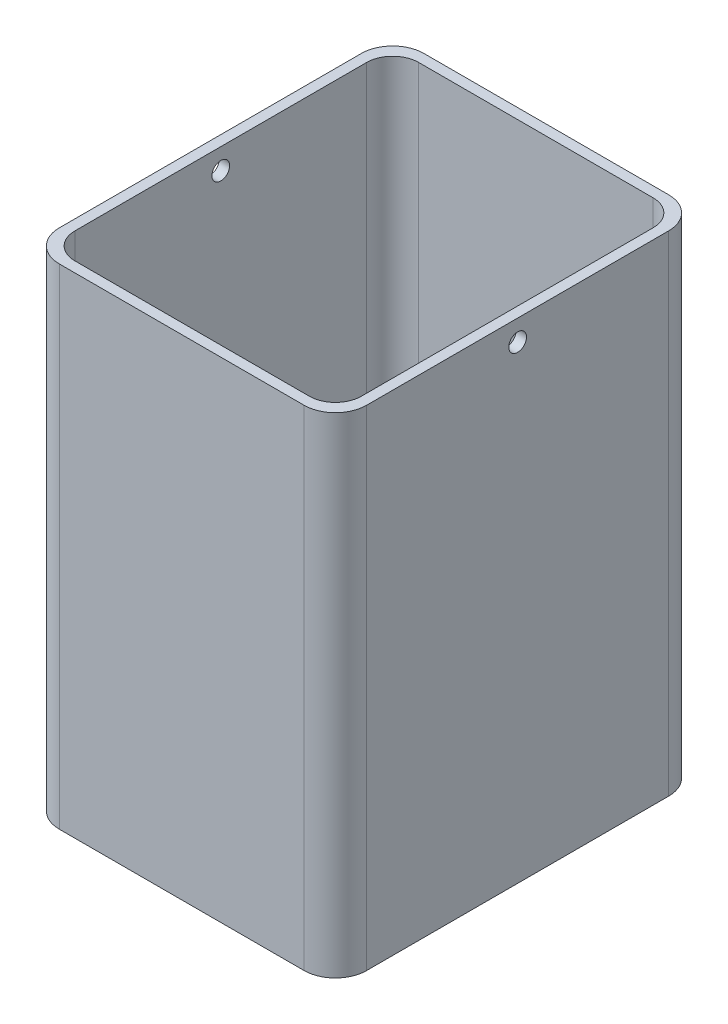
ISO-10303-21;
HEADER;
FILE_DESCRIPTION(('STEP AP214'),'2;1');
FILE_NAME('part.step','',(''),(''),'','','');
FILE_SCHEMA(('AUTOMOTIVE_DESIGN { 1 0 10303 214 1 1 1 1 }'));
ENDSEC;
DATA;
#1=APPLICATION_CONTEXT('core data for automotive mechanical design processes');
#2=APPLICATION_PROTOCOL_DEFINITION('international standard','automotive_design',2000,#1);
#3=PRODUCT_CONTEXT('',#1,'mechanical');
#4=PRODUCT('Part','Part','',(#3));
#5=PRODUCT_RELATED_PRODUCT_CATEGORY('part','',(#4));
#6=PRODUCT_DEFINITION_FORMATION('','',#4);
#7=PRODUCT_DEFINITION_CONTEXT('part definition',#1,'design');
#8=PRODUCT_DEFINITION('design','',#6,#7);
#9=PRODUCT_DEFINITION_SHAPE('','',#8);
#10=(LENGTH_UNIT() NAMED_UNIT(*) SI_UNIT(.MILLI.,.METRE.));
#11=(NAMED_UNIT(*) PLANE_ANGLE_UNIT() SI_UNIT($,.RADIAN.));
#12=(NAMED_UNIT(*) SI_UNIT($,.STERADIAN.) SOLID_ANGLE_UNIT());
#13=UNCERTAINTY_MEASURE_WITH_UNIT(LENGTH_MEASURE(1.E-05),#10,'distance_accuracy_value','');
#14=(GEOMETRIC_REPRESENTATION_CONTEXT(3) GLOBAL_UNCERTAINTY_ASSIGNED_CONTEXT((#13)) GLOBAL_UNIT_ASSIGNED_CONTEXT((#10,
#11,#12)) REPRESENTATION_CONTEXT('',''));
#15=CARTESIAN_POINT('',(0.,0.,0.));
#16=DIRECTION('',(0.,0.,1.));
#17=DIRECTION('',(1.,0.,0.));
#18=AXIS2_PLACEMENT_3D('',#15,#16,#17);
#19=CARTESIAN_POINT('',(0.,4.,70.0000002980232));
#20=DIRECTION('',(0.,0.,-1.));
#21=DIRECTION('',(-1.,0.,0.));
#22=AXIS2_PLACEMENT_3D('',#19,#20,#21);
#23=PLANE('',#22);
#24=DIRECTION('',(1.,0.,0.));
#25=VECTOR('',#24,1.);
#26=CARTESIAN_POINT('',(0.,0.,70.0000002980232));
#27=LINE('',#26,#25);
#28=CARTESIAN_POINT('',(6.00000098347664,0.,70.0000002980232));
#29=VERTEX_POINT('',#28);
#30=CARTESIAN_POINT('',(52.9999993741512,0.,70.0000002980232));
#31=VERTEX_POINT('',#30);
#32=EDGE_CURVE('E295',#29,#31,#27,.T.);
#33=ORIENTED_EDGE('',*,*,#32,.T.);
#34=DIRECTION('',(0.,-1.,0.));
#35=VECTOR('',#34,1.);
#36=CARTESIAN_POINT('',(52.9999993741512,4.,70.0000002980232));
#37=LINE('',#36,#35);
#38=CARTESIAN_POINT('',(53.0000003576278,94.,70.0000002980232));
#39=VERTEX_POINT('',#38);
#40=EDGE_CURVE('E12',#39,#31,#37,.T.);
#41=ORIENTED_EDGE('',*,*,#40,.F.);
#42=DIRECTION('',(-1.,0.,0.));
#43=VECTOR('',#42,1.);
#44=CARTESIAN_POINT('',(53.0000003576278,94.,70.0000002980232));
#45=LINE('',#44,#43);
#46=CARTESIAN_POINT('',(6.00000000000004,94.,70.0000002980232));
#47=VERTEX_POINT('',#46);
#48=EDGE_CURVE('E292',#39,#47,#45,.T.);
#49=ORIENTED_EDGE('',*,*,#48,.T.);
#50=DIRECTION('',(0.,-1.,0.));
#51=VECTOR('',#50,1.);
#52=CARTESIAN_POINT('',(6.00000098347664,4.,70.0000002980232));
#53=LINE('',#52,#51);
#54=EDGE_CURVE('E317',#47,#29,#53,.T.);
#55=ORIENTED_EDGE('',*,*,#54,.T.);
#56=EDGE_LOOP('',(#33,#41,#49,#55));
#57=FACE_BOUND('',#56,.T.);
#58=ADVANCED_FACE('F85',(#57),#23,.F.);
#59=CARTESIAN_POINT('',(52.9999975115061,4.,63.9999974519014));
#60=DIRECTION('',(0.,-1.,0.));
#61=DIRECTION('',(0.,0.,-1.));
#62=AXIS2_PLACEMENT_3D('',#59,#60,#61);
#63=CYLINDRICAL_SURFACE('',#62,6.00000284612208);
#64=CARTESIAN_POINT('',(52.9999975115061,0.,63.9999974519014));
#65=DIRECTION('',(0.,1.,0.));
#66=DIRECTION('',(0.,0.,1.));
#67=AXIS2_PLACEMENT_3D('',#64,#65,#66);
#68=CIRCLE('',#67,6.00000284612208);
#69=CARTESIAN_POINT('',(59.0000003576279,0.,63.9999955892563));
#70=VERTEX_POINT('',#69);
#71=EDGE_CURVE('E298',#31,#70,#68,.T.);
#72=ORIENTED_EDGE('',*,*,#71,.T.);
#73=DIRECTION('',(0.,-1.,0.));
#74=VECTOR('',#73,1.);
#75=CARTESIAN_POINT('',(59.0000003576279,4.,63.9999955892563));
#76=LINE('',#75,#74);
#77=CARTESIAN_POINT('',(59.0000003576279,94.,64.0000002980232));
#78=VERTEX_POINT('',#77);
#79=EDGE_CURVE('E93',#78,#70,#76,.T.);
#80=ORIENTED_EDGE('',*,*,#79,.F.);
#81=CARTESIAN_POINT('',(53.0000003576279,94.,64.0000002980232));
#82=DIRECTION('',(0.,1.,0.));
#83=DIRECTION('',(0.,0.,1.));
#84=AXIS2_PLACEMENT_3D('',#81,#82,#83);
#85=CIRCLE('',#84,6.);
#86=EDGE_CURVE('E256',#39,#78,#85,.T.);
#87=ORIENTED_EDGE('',*,*,#86,.F.);
#88=ORIENTED_EDGE('',*,*,#40,.T.);
#89=EDGE_LOOP('',(#72,#80,#87,#88));
#90=FACE_BOUND('',#89,.T.);
#91=ADVANCED_FACE('F337',(#90),#63,.T.);
#92=CARTESIAN_POINT('',(59.0000003576279,4.,0.));
#93=DIRECTION('',(1.,0.,0.));
#94=DIRECTION('',(0.,0.,-1.));
#95=AXIS2_PLACEMENT_3D('',#92,#93,#94);
#96=PLANE('',#95);
#97=CARTESIAN_POINT('',(59.0000003576279,90.,35.0000000976501));
#98=DIRECTION('',(1.,0.,0.));
#99=DIRECTION('',(0.,0.,-1.));
#100=AXIS2_PLACEMENT_3D('',#97,#98,#99);
#101=CIRCLE('',#100,1.7);
#102=CARTESIAN_POINT('',(59.0000003576279,90.,33.3000000976501));
#103=VERTEX_POINT('',#102);
#104=EDGE_CURVE('E384',#103,#103,#101,.T.);
#105=ORIENTED_EDGE('',*,*,#104,.F.);
#106=EDGE_LOOP('',(#105));
#107=FACE_BOUND('',#106,.T.);
#108=DIRECTION('',(0.,0.,1.));
#109=VECTOR('',#108,1.);
#110=CARTESIAN_POINT('',(59.0000003576279,0.,0.));
#111=LINE('',#110,#109);
#112=CARTESIAN_POINT('',(59.0000003576279,0.,6.00000098347664));
#113=VERTEX_POINT('',#112);
#114=EDGE_CURVE('E301',#113,#70,#111,.T.);
#115=ORIENTED_EDGE('',*,*,#114,.F.);
#116=DIRECTION('',(0.,-1.,0.));
#117=VECTOR('',#116,1.);
#118=CARTESIAN_POINT('',(59.0000003576279,4.,6.00000098347664));
#119=LINE('',#118,#117);
#120=CARTESIAN_POINT('',(59.0000003576279,94.,6.00000000000004));
#121=VERTEX_POINT('',#120);
#122=EDGE_CURVE('E329',#121,#113,#119,.T.);
#123=ORIENTED_EDGE('',*,*,#122,.F.);
#124=DIRECTION('',(0.,0.,1.));
#125=VECTOR('',#124,1.);
#126=CARTESIAN_POINT('',(59.0000003576279,94.,6.00000000000004));
#127=LINE('',#126,#125);
#128=EDGE_CURVE('E274',#121,#78,#127,.T.);
#129=ORIENTED_EDGE('',*,*,#128,.T.);
#130=ORIENTED_EDGE('',*,*,#79,.T.);
#131=EDGE_LOOP('',(#115,#123,#129,#130));
#132=FACE_BOUND('',#131,.T.);
#133=ADVANCED_FACE('F333',(#107,#132),#96,.T.);
#134=CARTESIAN_POINT('',(52.9999993741512,4.,6.00000098347665));
#135=DIRECTION('',(0.,-1.,0.));
#136=DIRECTION('',(0.,0.,-1.));
#137=AXIS2_PLACEMENT_3D('',#134,#135,#136);
#138=CYLINDRICAL_SURFACE('',#137,6.00000098347665);
#139=CARTESIAN_POINT('',(52.9999993741512,0.,6.00000098347665));
#140=DIRECTION('',(0.,1.,0.));
#141=DIRECTION('',(0.,0.,1.));
#142=AXIS2_PLACEMENT_3D('',#139,#140,#141);
#143=CIRCLE('',#142,6.00000098347665);
#144=CARTESIAN_POINT('',(52.9999993741512,0.,0.));
#145=VERTEX_POINT('',#144);
#146=EDGE_CURVE('E304',#145,#113,#143,.F.);
#147=ORIENTED_EDGE('',*,*,#146,.F.);
#148=DIRECTION('',(0.,-1.,0.));
#149=VECTOR('',#148,1.);
#150=CARTESIAN_POINT('',(52.9999993741512,4.,0.));
#151=LINE('',#150,#149);
#152=CARTESIAN_POINT('',(53.0000003576278,94.,0.));
#153=VERTEX_POINT('',#152);
#154=EDGE_CURVE('E327',#153,#145,#151,.T.);
#155=ORIENTED_EDGE('',*,*,#154,.F.);
#156=CARTESIAN_POINT('',(53.0000003576279,94.,6.));
#157=DIRECTION('',(0.,1.,0.));
#158=DIRECTION('',(0.,0.,1.));
#159=AXIS2_PLACEMENT_3D('',#156,#157,#158);
#160=CIRCLE('',#159,6.);
#161=EDGE_CURVE('E277',#121,#153,#160,.T.);
#162=ORIENTED_EDGE('',*,*,#161,.F.);
#163=ORIENTED_EDGE('',*,*,#122,.T.);
#164=EDGE_LOOP('',(#147,#155,#162,#163));
#165=FACE_BOUND('',#164,.T.);
#166=ADVANCED_FACE('F344',(#165),#138,.T.);
#167=CARTESIAN_POINT('',(0.,4.,0.));
#168=DIRECTION('',(0.,0.,-1.));
#169=DIRECTION('',(-1.,0.,0.));
#170=AXIS2_PLACEMENT_3D('',#167,#168,#169);
#171=PLANE('',#170);
#172=DIRECTION('',(1.,0.,0.));
#173=VECTOR('',#172,1.);
#174=CARTESIAN_POINT('',(0.,0.,0.));
#175=LINE('',#174,#173);
#176=CARTESIAN_POINT('',(6.00000098347664,0.,0.));
#177=VERTEX_POINT('',#176);
#178=EDGE_CURVE('E307',#177,#145,#175,.T.);
#179=ORIENTED_EDGE('',*,*,#178,.F.);
#180=DIRECTION('',(0.,-1.,0.));
#181=VECTOR('',#180,1.);
#182=CARTESIAN_POINT('',(6.00000098347664,4.,0.));
#183=LINE('',#182,#181);
#184=CARTESIAN_POINT('',(6.,94.,0.));
#185=VERTEX_POINT('',#184);
#186=EDGE_CURVE('E325',#185,#177,#183,.T.);
#187=ORIENTED_EDGE('',*,*,#186,.F.);
#188=DIRECTION('',(-1.,0.,0.));
#189=VECTOR('',#188,1.);
#190=CARTESIAN_POINT('',(53.0000003576278,94.,0.));
#191=LINE('',#190,#189);
#192=EDGE_CURVE('E280',#153,#185,#191,.T.);
#193=ORIENTED_EDGE('',*,*,#192,.F.);
#194=ORIENTED_EDGE('',*,*,#154,.T.);
#195=EDGE_LOOP('',(#179,#187,#193,#194));
#196=FACE_BOUND('',#195,.T.);
#197=ADVANCED_FACE('F362',(#196),#171,.T.);
#198=CARTESIAN_POINT('',(6.00000098347665,4.,6.00000098347665));
#199=DIRECTION('',(0.,-1.,0.));
#200=DIRECTION('',(0.,0.,-1.));
#201=AXIS2_PLACEMENT_3D('',#198,#199,#200);
#202=CYLINDRICAL_SURFACE('',#201,6.00000098347665);
#203=CARTESIAN_POINT('',(6.00000098347665,0.,6.00000098347665));
#204=DIRECTION('',(0.,1.,0.));
#205=DIRECTION('',(0.,0.,1.));
#206=AXIS2_PLACEMENT_3D('',#203,#204,#205);
#207=CIRCLE('',#206,6.00000098347665);
#208=CARTESIAN_POINT('',(0.,0.,6.00000098347664));
#209=VERTEX_POINT('',#208);
#210=EDGE_CURVE('E310',#209,#177,#207,.F.);
#211=ORIENTED_EDGE('',*,*,#210,.F.);
#212=DIRECTION('',(0.,-1.,0.));
#213=VECTOR('',#212,1.);
#214=CARTESIAN_POINT('',(0.,4.,6.00000098347664));
#215=LINE('',#214,#213);
#216=CARTESIAN_POINT('',(0.,94.,6.00000000000004));
#217=VERTEX_POINT('',#216);
#218=EDGE_CURVE('E323',#217,#209,#215,.T.);
#219=ORIENTED_EDGE('',*,*,#218,.F.);
#220=CARTESIAN_POINT('',(6.,94.,6.));
#221=DIRECTION('',(0.,-1.,0.));
#222=DIRECTION('',(0.,0.,-1.));
#223=AXIS2_PLACEMENT_3D('',#220,#221,#222);
#224=CIRCLE('',#223,6.);
#225=EDGE_CURVE('E283',#217,#185,#224,.T.);
#226=ORIENTED_EDGE('',*,*,#225,.T.);
#227=ORIENTED_EDGE('',*,*,#186,.T.);
#228=EDGE_LOOP('',(#211,#219,#226,#227));
#229=FACE_BOUND('',#228,.T.);
#230=ADVANCED_FACE('F360',(#229),#202,.T.);
#231=CARTESIAN_POINT('',(0.,4.,0.));
#232=DIRECTION('',(1.,0.,0.));
#233=DIRECTION('',(0.,0.,-1.));
#234=AXIS2_PLACEMENT_3D('',#231,#232,#233);
#235=PLANE('',#234);
#236=CARTESIAN_POINT('',(0.,90.,35.0000000976501));
#237=DIRECTION('',(1.,0.,0.));
#238=DIRECTION('',(0.,0.,-1.));
#239=AXIS2_PLACEMENT_3D('',#236,#237,#238);
#240=CIRCLE('',#239,1.7);
#241=CARTESIAN_POINT('',(0.,90.,33.3000000976501));
#242=VERTEX_POINT('',#241);
#243=EDGE_CURVE('E224',#242,#242,#240,.T.);
#244=ORIENTED_EDGE('',*,*,#243,.T.);
#245=EDGE_LOOP('',(#244));
#246=FACE_BOUND('',#245,.T.);
#247=DIRECTION('',(0.,0.,1.));
#248=VECTOR('',#247,1.);
#249=CARTESIAN_POINT('',(0.,0.,0.));
#250=LINE('',#249,#248);
#251=CARTESIAN_POINT('',(0.,0.,63.9999955892563));
#252=VERTEX_POINT('',#251);
#253=EDGE_CURVE('E313',#209,#252,#250,.T.);
#254=ORIENTED_EDGE('',*,*,#253,.T.);
#255=DIRECTION('',(0.,-1.,0.));
#256=VECTOR('',#255,1.);
#257=CARTESIAN_POINT('',(0.,4.,63.9999955892563));
#258=LINE('',#257,#256);
#259=CARTESIAN_POINT('',(0.,94.,64.0000002980232));
#260=VERTEX_POINT('',#259);
#261=EDGE_CURVE('E320',#260,#252,#258,.T.);
#262=ORIENTED_EDGE('',*,*,#261,.F.);
#263=DIRECTION('',(0.,0.,-1.));
#264=VECTOR('',#263,1.);
#265=CARTESIAN_POINT('',(0.,94.,64.0000002980232));
#266=LINE('',#265,#264);
#267=EDGE_CURVE('E286',#260,#217,#266,.T.);
#268=ORIENTED_EDGE('',*,*,#267,.T.);
#269=ORIENTED_EDGE('',*,*,#218,.T.);
#270=EDGE_LOOP('',(#254,#262,#268,#269));
#271=FACE_BOUND('',#270,.T.);
#272=ADVANCED_FACE('F357',(#246,#271),#235,.F.);
#273=CARTESIAN_POINT('',(5.99999656520715,4.,64.0000037328122));
#274=DIRECTION('',(0.,-1.,0.));
#275=DIRECTION('',(0.,0.,-1.));
#276=AXIS2_PLACEMENT_3D('',#273,#274,#275);
#277=CYLINDRICAL_SURFACE('',#276,5.99999656521268);
#278=CARTESIAN_POINT('',(5.99999656520715,0.,64.0000037328122));
#279=DIRECTION('',(0.,1.,0.));
#280=DIRECTION('',(0.,0.,1.));
#281=AXIS2_PLACEMENT_3D('',#278,#279,#280);
#282=CIRCLE('',#281,5.99999656521268);
#283=EDGE_CURVE('E315',#252,#29,#282,.T.);
#284=ORIENTED_EDGE('',*,*,#283,.T.);
#285=ORIENTED_EDGE('',*,*,#54,.F.);
#286=CARTESIAN_POINT('',(6.,94.,64.0000002980232));
#287=DIRECTION('',(0.,-1.,0.));
#288=DIRECTION('',(0.,0.,-1.));
#289=AXIS2_PLACEMENT_3D('',#286,#287,#288);
#290=CIRCLE('',#289,6.);
#291=EDGE_CURVE('E289',#47,#260,#290,.T.);
#292=ORIENTED_EDGE('',*,*,#291,.T.);
#293=ORIENTED_EDGE('',*,*,#261,.T.);
#294=EDGE_LOOP('',(#284,#285,#292,#293));
#295=FACE_BOUND('',#294,.T.);
#296=ADVANCED_FACE('F355',(#295),#277,.T.);
#297=CARTESIAN_POINT('',(0.,0.,0.));
#298=DIRECTION('',(0.,1.,0.));
#299=DIRECTION('',(0.,0.,1.));
#300=AXIS2_PLACEMENT_3D('',#297,#298,#299);
#301=PLANE('',#300);
#302=ORIENTED_EDGE('',*,*,#32,.F.);
#303=ORIENTED_EDGE('',*,*,#283,.F.);
#304=ORIENTED_EDGE('',*,*,#253,.F.);
#305=ORIENTED_EDGE('',*,*,#210,.T.);
#306=ORIENTED_EDGE('',*,*,#178,.T.);
#307=ORIENTED_EDGE('',*,*,#146,.T.);
#308=ORIENTED_EDGE('',*,*,#114,.T.);
#309=ORIENTED_EDGE('',*,*,#71,.F.);
#310=EDGE_LOOP('',(#302,#303,#304,#305,#306,#307,#308,#309));
#311=FACE_BOUND('',#310,.T.);
#312=ADVANCED_FACE('F340',(#311),#301,.F.);
#313=CARTESIAN_POINT('',(53.0000003576279,94.,64.0000002980232));
#314=DIRECTION('',(0.,1.,0.));
#315=DIRECTION('',(0.,0.,1.));
#316=AXIS2_PLACEMENT_3D('',#313,#314,#315);
#317=PLANE('',#316);
#318=CARTESIAN_POINT('',(7.,94.,63.0000002980232));
#319=DIRECTION('',(0.,-1.,0.));
#320=DIRECTION('',(0.,0.,-1.));
#321=AXIS2_PLACEMENT_3D('',#318,#319,#320);
#322=CIRCLE('',#321,5.);
#323=CARTESIAN_POINT('',(7.00000000000003,94.,68.0000002980232));
#324=VERTEX_POINT('',#323);
#325=CARTESIAN_POINT('',(2.00000000000001,94.,63.0000002980232));
#326=VERTEX_POINT('',#325);
#327=EDGE_CURVE('E209',#324,#326,#322,.T.);
#328=ORIENTED_EDGE('',*,*,#327,.T.);
#329=DIRECTION('',(0.,0.,1.));
#330=VECTOR('',#329,1.);
#331=CARTESIAN_POINT('',(2.,94.,7.00000000000003));
#332=LINE('',#331,#330);
#333=CARTESIAN_POINT('',(2.,94.,7.00000000000004));
#334=VERTEX_POINT('',#333);
#335=EDGE_CURVE('E198',#334,#326,#332,.T.);
#336=ORIENTED_EDGE('',*,*,#335,.F.);
#337=CARTESIAN_POINT('',(7.,94.,7.));
#338=DIRECTION('',(0.,-1.,0.));
#339=DIRECTION('',(0.,0.,-1.));
#340=AXIS2_PLACEMENT_3D('',#337,#338,#339);
#341=CIRCLE('',#340,5.);
#342=CARTESIAN_POINT('',(7.00000000000002,94.,2.));
#343=VERTEX_POINT('',#342);
#344=EDGE_CURVE('E208',#334,#343,#341,.T.);
#345=ORIENTED_EDGE('',*,*,#344,.T.);
#346=DIRECTION('',(1.,0.,0.));
#347=VECTOR('',#346,1.);
#348=CARTESIAN_POINT('',(7.00000000000002,94.,2.));
#349=LINE('',#348,#347);
#350=CARTESIAN_POINT('',(52.0000003576278,94.,2.));
#351=VERTEX_POINT('',#350);
#352=EDGE_CURVE('E228',#343,#351,#349,.T.);
#353=ORIENTED_EDGE('',*,*,#352,.T.);
#354=CARTESIAN_POINT('',(52.0000003576279,94.,7.));
#355=DIRECTION('',(0.,-1.,0.));
#356=DIRECTION('',(0.,0.,-1.));
#357=AXIS2_PLACEMENT_3D('',#354,#355,#356);
#358=CIRCLE('',#357,5.);
#359=CARTESIAN_POINT('',(57.0000003576279,94.,7.00000000000002));
#360=VERTEX_POINT('',#359);
#361=EDGE_CURVE('E231',#351,#360,#358,.T.);
#362=ORIENTED_EDGE('',*,*,#361,.T.);
#363=DIRECTION('',(0.,0.,-1.));
#364=VECTOR('',#363,1.);
#365=CARTESIAN_POINT('',(57.0000003576279,94.,63.0000002980232));
#366=LINE('',#365,#364);
#367=CARTESIAN_POINT('',(57.0000003576279,94.,63.0000002980232));
#368=VERTEX_POINT('',#367);
#369=EDGE_CURVE('E234',#368,#360,#366,.T.);
#370=ORIENTED_EDGE('',*,*,#369,.F.);
#371=CARTESIAN_POINT('',(52.0000003576279,94.,63.0000002980232));
#372=DIRECTION('',(0.,1.,0.));
#373=DIRECTION('',(0.,0.,1.));
#374=AXIS2_PLACEMENT_3D('',#371,#372,#373);
#375=CIRCLE('',#374,5.);
#376=CARTESIAN_POINT('',(52.0000003576278,94.,68.0000002980232));
#377=VERTEX_POINT('',#376);
#378=EDGE_CURVE('E236',#377,#368,#375,.T.);
#379=ORIENTED_EDGE('',*,*,#378,.F.);
#380=DIRECTION('',(1.,0.,0.));
#381=VECTOR('',#380,1.);
#382=CARTESIAN_POINT('',(7.00000000000003,94.,68.0000002980232));
#383=LINE('',#382,#381);
#384=EDGE_CURVE('E215',#324,#377,#383,.T.);
#385=ORIENTED_EDGE('',*,*,#384,.F.);
#386=EDGE_LOOP('',(#328,#336,#345,#353,#362,#370,#379,#385));
#387=FACE_BOUND('',#386,.T.);
#388=ORIENTED_EDGE('',*,*,#86,.T.);
#389=ORIENTED_EDGE('',*,*,#128,.F.);
#390=ORIENTED_EDGE('',*,*,#161,.T.);
#391=ORIENTED_EDGE('',*,*,#192,.T.);
#392=ORIENTED_EDGE('',*,*,#225,.F.);
#393=ORIENTED_EDGE('',*,*,#267,.F.);
#394=ORIENTED_EDGE('',*,*,#291,.F.);
#395=ORIENTED_EDGE('',*,*,#48,.F.);
#396=EDGE_LOOP('',(#388,#389,#390,#391,#392,#393,#394,#395));
#397=FACE_BOUND('',#396,.T.);
#398=ADVANCED_FACE('F217',(#387,#397),#317,.T.);
#399=CARTESIAN_POINT('',(7.,94.,63.0000002980232));
#400=DIRECTION('',(0.,-1.,0.));
#401=DIRECTION('',(0.,0.,-1.));
#402=AXIS2_PLACEMENT_3D('',#399,#400,#401);
#403=CYLINDRICAL_SURFACE('',#402,5.);
#404=CARTESIAN_POINT('',(7.,4.,63.0000002980232));
#405=DIRECTION('',(0.,-1.,0.));
#406=DIRECTION('',(0.,0.,-1.));
#407=AXIS2_PLACEMENT_3D('',#404,#405,#406);
#408=CIRCLE('',#407,5.);
#409=CARTESIAN_POINT('',(7.00000000000003,4.,68.0000002980232));
#410=VERTEX_POINT('',#409);
#411=CARTESIAN_POINT('',(2.00000000000001,4.,63.0000002980232));
#412=VERTEX_POINT('',#411);
#413=EDGE_CURVE('E100',#410,#412,#408,.T.);
#414=ORIENTED_EDGE('',*,*,#413,.T.);
#415=DIRECTION('',(0.,-1.,0.));
#416=VECTOR('',#415,1.);
#417=CARTESIAN_POINT('',(2.00000000000001,94.,63.0000002980232));
#418=LINE('',#417,#416);
#419=EDGE_CURVE('E202',#326,#412,#418,.T.);
#420=ORIENTED_EDGE('',*,*,#419,.F.);
#421=ORIENTED_EDGE('',*,*,#327,.F.);
#422=DIRECTION('',(0.,-1.,0.));
#423=VECTOR('',#422,1.);
#424=CARTESIAN_POINT('',(7.00000000000003,94.,68.0000002980232));
#425=LINE('',#424,#423);
#426=EDGE_CURVE('E254',#324,#410,#425,.T.);
#427=ORIENTED_EDGE('',*,*,#426,.T.);
#428=EDGE_LOOP('',(#414,#420,#421,#427));
#429=FACE_BOUND('',#428,.T.);
#430=ADVANCED_FACE('F213',(#429),#403,.F.);
#431=CARTESIAN_POINT('',(7.00000000000003,94.,68.0000002980232));
#432=DIRECTION('',(0.,0.,-1.));
#433=DIRECTION('',(-1.,0.,0.));
#434=AXIS2_PLACEMENT_3D('',#431,#432,#433);
#435=PLANE('',#434);
#436=DIRECTION('',(1.,0.,0.));
#437=VECTOR('',#436,1.);
#438=CARTESIAN_POINT('',(7.00000000000003,4.,68.0000002980232));
#439=LINE('',#438,#437);
#440=CARTESIAN_POINT('',(52.0000003576279,4.,68.0000002980232));
#441=VERTEX_POINT('',#440);
#442=EDGE_CURVE('E105',#410,#441,#439,.T.);
#443=ORIENTED_EDGE('',*,*,#442,.F.);
#444=ORIENTED_EDGE('',*,*,#426,.F.);
#445=ORIENTED_EDGE('',*,*,#384,.T.);
#446=DIRECTION('',(0.,-1.,0.));
#447=VECTOR('',#446,1.);
#448=CARTESIAN_POINT('',(52.0000003576278,94.,68.0000002980232));
#449=LINE('',#448,#447);
#450=EDGE_CURVE('E257',#377,#441,#449,.T.);
#451=ORIENTED_EDGE('',*,*,#450,.T.);
#452=EDGE_LOOP('',(#443,#444,#445,#451));
#453=FACE_BOUND('',#452,.T.);
#454=ADVANCED_FACE('F408',(#453),#435,.T.);
#455=CARTESIAN_POINT('',(52.0000003576279,94.,63.0000002980232));
#456=DIRECTION('',(0.,-1.,0.));
#457=DIRECTION('',(0.,0.,-1.));
#458=AXIS2_PLACEMENT_3D('',#455,#456,#457);
#459=CYLINDRICAL_SURFACE('',#458,5.);
#460=CARTESIAN_POINT('',(52.0000003576279,4.,63.0000002980232));
#461=DIRECTION('',(0.,1.,0.));
#462=DIRECTION('',(0.,0.,1.));
#463=AXIS2_PLACEMENT_3D('',#460,#461,#462);
#464=CIRCLE('',#463,5.);
#465=CARTESIAN_POINT('',(57.0000003576279,4.,63.0000002980232));
#466=VERTEX_POINT('',#465);
#467=EDGE_CURVE('E221',#441,#466,#464,.T.);
#468=ORIENTED_EDGE('',*,*,#467,.F.);
#469=ORIENTED_EDGE('',*,*,#450,.F.);
#470=ORIENTED_EDGE('',*,*,#378,.T.);
#471=DIRECTION('',(0.,-1.,0.));
#472=VECTOR('',#471,1.);
#473=CARTESIAN_POINT('',(57.0000003576279,94.,63.0000002980232));
#474=LINE('',#473,#472);
#475=EDGE_CURVE('E259',#368,#466,#474,.T.);
#476=ORIENTED_EDGE('',*,*,#475,.T.);
#477=EDGE_LOOP('',(#468,#469,#470,#476));
#478=FACE_BOUND('',#477,.T.);
#479=ADVANCED_FACE('F411',(#478),#459,.F.);
#480=CARTESIAN_POINT('',(57.0000003576279,94.,63.0000002980232));
#481=DIRECTION('',(-1.,0.,0.));
#482=DIRECTION('',(0.,0.,1.));
#483=AXIS2_PLACEMENT_3D('',#480,#481,#482);
#484=PLANE('',#483);
#485=CARTESIAN_POINT('',(57.0000003576279,90.,35.0000000976501));
#486=DIRECTION('',(-1.,0.,0.));
#487=DIRECTION('',(0.,0.,1.));
#488=AXIS2_PLACEMENT_3D('',#485,#486,#487);
#489=CIRCLE('',#488,1.7);
#490=CARTESIAN_POINT('',(57.0000003576279,90.,36.7000000976501));
#491=VERTEX_POINT('',#490);
#492=EDGE_CURVE('E388',#491,#491,#489,.T.);
#493=ORIENTED_EDGE('',*,*,#492,.F.);
#494=EDGE_LOOP('',(#493));
#495=FACE_BOUND('',#494,.T.);
#496=DIRECTION('',(0.,0.,-1.));
#497=VECTOR('',#496,1.);
#498=CARTESIAN_POINT('',(57.0000003576279,4.,63.0000002980232));
#499=LINE('',#498,#497);
#500=CARTESIAN_POINT('',(57.0000003576279,4.,7.00000000000002));
#501=VERTEX_POINT('',#500);
#502=EDGE_CURVE('E251',#466,#501,#499,.T.);
#503=ORIENTED_EDGE('',*,*,#502,.F.);
#504=ORIENTED_EDGE('',*,*,#475,.F.);
#505=ORIENTED_EDGE('',*,*,#369,.T.);
#506=DIRECTION('',(0.,-1.,0.));
#507=VECTOR('',#506,1.);
#508=CARTESIAN_POINT('',(57.0000003576279,94.,7.00000000000002));
#509=LINE('',#508,#507);
#510=EDGE_CURVE('E262',#360,#501,#509,.T.);
#511=ORIENTED_EDGE('',*,*,#510,.T.);
#512=EDGE_LOOP('',(#503,#504,#505,#511));
#513=FACE_BOUND('',#512,.T.);
#514=ADVANCED_FACE('F415',(#495,#513),#484,.T.);
#515=CARTESIAN_POINT('',(52.0000003576279,94.,7.));
#516=DIRECTION('',(0.,-1.,0.));
#517=DIRECTION('',(0.,0.,-1.));
#518=AXIS2_PLACEMENT_3D('',#515,#516,#517);
#519=CYLINDRICAL_SURFACE('',#518,5.);
#520=CARTESIAN_POINT('',(52.0000003576279,4.,7.));
#521=DIRECTION('',(0.,-1.,0.));
#522=DIRECTION('',(0.,0.,-1.));
#523=AXIS2_PLACEMENT_3D('',#520,#521,#522);
#524=CIRCLE('',#523,5.);
#525=CARTESIAN_POINT('',(52.0000003576278,4.,2.));
#526=VERTEX_POINT('',#525);
#527=EDGE_CURVE('E248',#526,#501,#524,.T.);
#528=ORIENTED_EDGE('',*,*,#527,.T.);
#529=ORIENTED_EDGE('',*,*,#510,.F.);
#530=ORIENTED_EDGE('',*,*,#361,.F.);
#531=DIRECTION('',(0.,-1.,0.));
#532=VECTOR('',#531,1.);
#533=CARTESIAN_POINT('',(52.0000003576278,94.,2.));
#534=LINE('',#533,#532);
#535=EDGE_CURVE('E265',#351,#526,#534,.T.);
#536=ORIENTED_EDGE('',*,*,#535,.T.);
#537=EDGE_LOOP('',(#528,#529,#530,#536));
#538=FACE_BOUND('',#537,.T.);
#539=ADVANCED_FACE('F419',(#538),#519,.F.);
#540=CARTESIAN_POINT('',(7.00000000000002,94.,2.));
#541=DIRECTION('',(0.,0.,-1.));
#542=DIRECTION('',(-1.,0.,0.));
#543=AXIS2_PLACEMENT_3D('',#540,#541,#542);
#544=PLANE('',#543);
#545=DIRECTION('',(1.,0.,0.));
#546=VECTOR('',#545,1.);
#547=CARTESIAN_POINT('',(7.00000000000002,4.,2.));
#548=LINE('',#547,#546);
#549=CARTESIAN_POINT('',(7.00000000000002,4.,2.));
#550=VERTEX_POINT('',#549);
#551=EDGE_CURVE('E245',#550,#526,#548,.T.);
#552=ORIENTED_EDGE('',*,*,#551,.T.);
#553=ORIENTED_EDGE('',*,*,#535,.F.);
#554=ORIENTED_EDGE('',*,*,#352,.F.);
#555=DIRECTION('',(0.,-1.,0.));
#556=VECTOR('',#555,1.);
#557=CARTESIAN_POINT('',(7.00000000000002,94.,2.));
#558=LINE('',#557,#556);
#559=EDGE_CURVE('E268',#343,#550,#558,.T.);
#560=ORIENTED_EDGE('',*,*,#559,.T.);
#561=EDGE_LOOP('',(#552,#553,#554,#560));
#562=FACE_BOUND('',#561,.T.);
#563=ADVANCED_FACE('F423',(#562),#544,.F.);
#564=CARTESIAN_POINT('',(7.,94.,7.));
#565=DIRECTION('',(0.,-1.,0.));
#566=DIRECTION('',(0.,0.,-1.));
#567=AXIS2_PLACEMENT_3D('',#564,#565,#566);
#568=CYLINDRICAL_SURFACE('',#567,5.);
#569=CARTESIAN_POINT('',(7.,4.,7.));
#570=DIRECTION('',(0.,-1.,0.));
#571=DIRECTION('',(0.,0.,-1.));
#572=AXIS2_PLACEMENT_3D('',#569,#570,#571);
#573=CIRCLE('',#572,5.);
#574=CARTESIAN_POINT('',(2.,4.,7.00000000000004));
#575=VERTEX_POINT('',#574);
#576=EDGE_CURVE('E242',#575,#550,#573,.T.);
#577=ORIENTED_EDGE('',*,*,#576,.T.);
#578=ORIENTED_EDGE('',*,*,#559,.F.);
#579=ORIENTED_EDGE('',*,*,#344,.F.);
#580=DIRECTION('',(0.,-1.,0.));
#581=VECTOR('',#580,1.);
#582=CARTESIAN_POINT('',(2.,94.,7.00000000000004));
#583=LINE('',#582,#581);
#584=EDGE_CURVE('E204',#334,#575,#583,.T.);
#585=ORIENTED_EDGE('',*,*,#584,.T.);
#586=EDGE_LOOP('',(#577,#578,#579,#585));
#587=FACE_BOUND('',#586,.T.);
#588=ADVANCED_FACE('F427',(#587),#568,.F.);
#589=CARTESIAN_POINT('',(2.,94.,7.00000000000003));
#590=DIRECTION('',(1.,0.,0.));
#591=DIRECTION('',(0.,0.,-1.));
#592=AXIS2_PLACEMENT_3D('',#589,#590,#591);
#593=PLANE('',#592);
#594=CARTESIAN_POINT('',(1.99999999999999,90.,35.0000000976501));
#595=DIRECTION('',(1.,0.,0.));
#596=DIRECTION('',(0.,0.,-1.));
#597=AXIS2_PLACEMENT_3D('',#594,#595,#596);
#598=CIRCLE('',#597,1.7);
#599=CARTESIAN_POINT('',(1.99999999999999,90.,33.3000000976501));
#600=VERTEX_POINT('',#599);
#601=EDGE_CURVE('E88',#600,#600,#598,.T.);
#602=ORIENTED_EDGE('',*,*,#601,.F.);
#603=EDGE_LOOP('',(#602));
#604=FACE_BOUND('',#603,.T.);
#605=DIRECTION('',(0.,0.,1.));
#606=VECTOR('',#605,1.);
#607=CARTESIAN_POINT('',(2.,4.,7.00000000000003));
#608=LINE('',#607,#606);
#609=EDGE_CURVE('E240',#575,#412,#608,.T.);
#610=ORIENTED_EDGE('',*,*,#609,.F.);
#611=ORIENTED_EDGE('',*,*,#584,.F.);
#612=ORIENTED_EDGE('',*,*,#335,.T.);
#613=ORIENTED_EDGE('',*,*,#419,.T.);
#614=EDGE_LOOP('',(#610,#611,#612,#613));
#615=FACE_BOUND('',#614,.T.);
#616=ADVANCED_FACE('F201',(#604,#615),#593,.T.);
#617=CARTESIAN_POINT('',(0.,4.,0.));
#618=DIRECTION('',(0.,1.,0.));
#619=DIRECTION('',(0.,0.,1.));
#620=AXIS2_PLACEMENT_3D('',#617,#618,#619);
#621=PLANE('',#620);
#622=ORIENTED_EDGE('',*,*,#609,.T.);
#623=ORIENTED_EDGE('',*,*,#413,.F.);
#624=ORIENTED_EDGE('',*,*,#442,.T.);
#625=ORIENTED_EDGE('',*,*,#467,.T.);
#626=ORIENTED_EDGE('',*,*,#502,.T.);
#627=ORIENTED_EDGE('',*,*,#527,.F.);
#628=ORIENTED_EDGE('',*,*,#551,.F.);
#629=ORIENTED_EDGE('',*,*,#576,.F.);
#630=EDGE_LOOP('',(#622,#623,#624,#625,#626,#627,#628,#629));
#631=FACE_BOUND('',#630,.T.);
#632=ADVANCED_FACE('F399',(#631),#621,.T.);
#633=CARTESIAN_POINT('',(-33.9999996423721,90.,35.0000000976501));
#634=DIRECTION('',(1.,0.,0.));
#635=DIRECTION('',(0.,0.,-1.));
#636=AXIS2_PLACEMENT_3D('',#633,#634,#635);
#637=CYLINDRICAL_SURFACE('',#636,1.7);
#638=ORIENTED_EDGE('',*,*,#601,.T.);
#639=EDGE_LOOP('',(#638));
#640=FACE_BOUND('',#639,.T.);
#641=ORIENTED_EDGE('',*,*,#243,.F.);
#642=EDGE_LOOP('',(#641));
#643=FACE_BOUND('',#642,.T.);
#644=ADVANCED_FACE('F396',(#640,#643),#637,.F.);
#645=ORIENTED_EDGE('',*,*,#492,.T.);
#646=EDGE_LOOP('',(#645));
#647=FACE_BOUND('',#646,.T.);
#648=ORIENTED_EDGE('',*,*,#104,.T.);
#649=EDGE_LOOP('',(#648));
#650=FACE_BOUND('',#649,.T.);
#651=ADVANCED_FACE('F398',(#647,#650),#637,.F.);
#652=CLOSED_SHELL('',(#58,#91,#133,#166,#197,#230,#272,#296,#312,#398,#430,#454,#479,#514,#539,
#563,#588,#616,#632,#644,#651));
#653=MANIFOLD_SOLID_BREP('B2',#652);
#654=ADVANCED_BREP_SHAPE_REPRESENTATION('',(#18,#653),#14);
#655=SHAPE_DEFINITION_REPRESENTATION(#9,#654);
ENDSEC;
END-ISO-10303-21;
